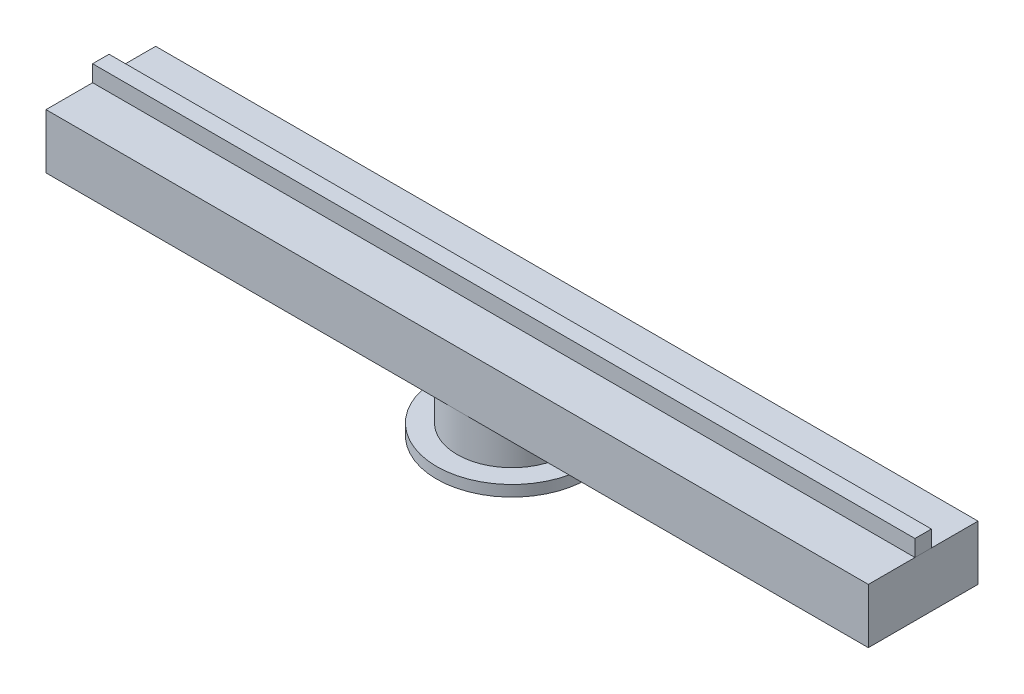
ISO-10303-21;
HEADER;
FILE_DESCRIPTION(('STEP AP214'),'2;1');
FILE_NAME('part.step','',(''),(''),'','','');
FILE_SCHEMA(('AUTOMOTIVE_DESIGN { 1 0 10303 214 1 1 1 1 }'));
ENDSEC;
DATA;
#1=APPLICATION_CONTEXT('core data for automotive mechanical design processes');
#2=APPLICATION_PROTOCOL_DEFINITION('international standard','automotive_design',2000,#1);
#3=PRODUCT_CONTEXT('',#1,'mechanical');
#4=PRODUCT('Part','Part','',(#3));
#5=PRODUCT_RELATED_PRODUCT_CATEGORY('part','',(#4));
#6=PRODUCT_DEFINITION_FORMATION('','',#4);
#7=PRODUCT_DEFINITION_CONTEXT('part definition',#1,'design');
#8=PRODUCT_DEFINITION('design','',#6,#7);
#9=PRODUCT_DEFINITION_SHAPE('','',#8);
#10=(LENGTH_UNIT() NAMED_UNIT(*) SI_UNIT(.MILLI.,.METRE.));
#11=(NAMED_UNIT(*) PLANE_ANGLE_UNIT() SI_UNIT($,.RADIAN.));
#12=(NAMED_UNIT(*) SI_UNIT($,.STERADIAN.) SOLID_ANGLE_UNIT());
#13=UNCERTAINTY_MEASURE_WITH_UNIT(LENGTH_MEASURE(1.E-05),#10,'distance_accuracy_value','');
#14=(GEOMETRIC_REPRESENTATION_CONTEXT(3) GLOBAL_UNCERTAINTY_ASSIGNED_CONTEXT((#13)) GLOBAL_UNIT_ASSIGNED_CONTEXT((#10,
#11,#12)) REPRESENTATION_CONTEXT('',''));
#15=CARTESIAN_POINT('',(0.,0.,0.));
#16=DIRECTION('',(0.,0.,1.));
#17=DIRECTION('',(1.,0.,0.));
#18=AXIS2_PLACEMENT_3D('',#15,#16,#17);
#19=CARTESIAN_POINT('',(750.,100.,15.));
#20=DIRECTION('',(0.,1.,0.));
#21=DIRECTION('',(-1.,0.,0.));
#22=AXIS2_PLACEMENT_3D('',#19,#20,#21);
#23=PLANE('',#22);
#24=DIRECTION('',(1.,0.,0.));
#25=VECTOR('',#24,1.);
#26=CARTESIAN_POINT('',(750.,100.,-15.));
#27=LINE('',#26,#25);
#28=CARTESIAN_POINT('',(-750.,99.9999999999998,-15.));
#29=VERTEX_POINT('',#28);
#30=CARTESIAN_POINT('',(750.,100.,-15.));
#31=VERTEX_POINT('',#30);
#32=EDGE_CURVE('E110',#29,#31,#27,.T.);
#33=ORIENTED_EDGE('',*,*,#32,.T.);
#34=DIRECTION('',(0.,0.,-1.));
#35=VECTOR('',#34,1.);
#36=CARTESIAN_POINT('',(750.,100.,15.));
#37=LINE('',#36,#35);
#38=CARTESIAN_POINT('',(750.,100.,15.));
#39=VERTEX_POINT('',#38);
#40=EDGE_CURVE('E12',#39,#31,#37,.T.);
#41=ORIENTED_EDGE('',*,*,#40,.F.);
#42=DIRECTION('',(1.,0.,0.));
#43=VECTOR('',#42,1.);
#44=CARTESIAN_POINT('',(750.,100.,15.));
#45=LINE('',#44,#43);
#46=CARTESIAN_POINT('',(-750.,99.9999999999998,15.));
#47=VERTEX_POINT('',#46);
#48=EDGE_CURVE('E98',#47,#39,#45,.T.);
#49=ORIENTED_EDGE('',*,*,#48,.F.);
#50=DIRECTION('',(0.,0.,-1.));
#51=VECTOR('',#50,1.);
#52=CARTESIAN_POINT('',(-750.,99.9999999999998,15.));
#53=LINE('',#52,#51);
#54=EDGE_CURVE('E106',#47,#29,#53,.T.);
#55=ORIENTED_EDGE('',*,*,#54,.T.);
#56=EDGE_LOOP('',(#33,#41,#49,#55));
#57=FACE_BOUND('',#56,.T.);
#58=ADVANCED_FACE('F47',(#57),#23,.F.);
#59=CARTESIAN_POINT('',(750.,130.,15.));
#60=DIRECTION('',(-1.,0.,0.));
#61=DIRECTION('',(0.,0.,1.));
#62=AXIS2_PLACEMENT_3D('',#59,#60,#61);
#63=PLANE('',#62);
#64=DIRECTION('',(0.,1.,0.));
#65=VECTOR('',#64,1.);
#66=CARTESIAN_POINT('',(750.,130.,-15.));
#67=LINE('',#66,#65);
#68=CARTESIAN_POINT('',(750.,130.,-15.));
#69=VERTEX_POINT('',#68);
#70=EDGE_CURVE('E102',#31,#69,#67,.T.);
#71=ORIENTED_EDGE('',*,*,#70,.T.);
#72=DIRECTION('',(0.,0.,-1.));
#73=VECTOR('',#72,1.);
#74=CARTESIAN_POINT('',(750.,130.,15.));
#75=LINE('',#74,#73);
#76=CARTESIAN_POINT('',(750.,130.,15.));
#77=VERTEX_POINT('',#76);
#78=EDGE_CURVE('E55',#77,#69,#75,.T.);
#79=ORIENTED_EDGE('',*,*,#78,.F.);
#80=DIRECTION('',(0.,1.,0.));
#81=VECTOR('',#80,1.);
#82=CARTESIAN_POINT('',(750.,130.,15.));
#83=LINE('',#82,#81);
#84=EDGE_CURVE('E93',#39,#77,#83,.T.);
#85=ORIENTED_EDGE('',*,*,#84,.F.);
#86=ORIENTED_EDGE('',*,*,#40,.T.);
#87=EDGE_LOOP('',(#71,#79,#85,#86));
#88=FACE_BOUND('',#87,.T.);
#89=ADVANCED_FACE('F101',(#88),#63,.F.);
#90=CARTESIAN_POINT('',(-750.,130.,15.));
#91=DIRECTION('',(0.,-1.,0.));
#92=DIRECTION('',(0.,0.,-1.));
#93=AXIS2_PLACEMENT_3D('',#90,#91,#92);
#94=PLANE('',#93);
#95=DIRECTION('',(-1.,0.,0.));
#96=VECTOR('',#95,1.);
#97=CARTESIAN_POINT('',(-750.,130.,-15.));
#98=LINE('',#97,#96);
#99=CARTESIAN_POINT('',(-750.,130.,-15.));
#100=VERTEX_POINT('',#99);
#101=EDGE_CURVE('E80',#69,#100,#98,.T.);
#102=ORIENTED_EDGE('',*,*,#101,.T.);
#103=DIRECTION('',(0.,0.,-1.));
#104=VECTOR('',#103,1.);
#105=CARTESIAN_POINT('',(-750.,130.,15.));
#106=LINE('',#105,#104);
#107=CARTESIAN_POINT('',(-750.,130.,15.));
#108=VERTEX_POINT('',#107);
#109=EDGE_CURVE('E103',#108,#100,#106,.T.);
#110=ORIENTED_EDGE('',*,*,#109,.F.);
#111=DIRECTION('',(-1.,0.,0.));
#112=VECTOR('',#111,1.);
#113=CARTESIAN_POINT('',(-750.,130.,15.));
#114=LINE('',#113,#112);
#115=EDGE_CURVE('E96',#77,#108,#114,.T.);
#116=ORIENTED_EDGE('',*,*,#115,.F.);
#117=ORIENTED_EDGE('',*,*,#78,.T.);
#118=EDGE_LOOP('',(#102,#110,#116,#117));
#119=FACE_BOUND('',#118,.T.);
#120=ADVANCED_FACE('F104',(#119),#94,.F.);
#121=CARTESIAN_POINT('',(-750.,99.9999999999998,15.));
#122=DIRECTION('',(1.,0.,0.));
#123=DIRECTION('',(0.,0.,-1.));
#124=AXIS2_PLACEMENT_3D('',#121,#122,#123);
#125=PLANE('',#124);
#126=DIRECTION('',(0.,-1.,0.));
#127=VECTOR('',#126,1.);
#128=CARTESIAN_POINT('',(-750.,99.9999999999998,-15.));
#129=LINE('',#128,#127);
#130=EDGE_CURVE('E86',#100,#29,#129,.T.);
#131=ORIENTED_EDGE('',*,*,#130,.T.);
#132=ORIENTED_EDGE('',*,*,#54,.F.);
#133=DIRECTION('',(0.,-1.,0.));
#134=VECTOR('',#133,1.);
#135=CARTESIAN_POINT('',(-750.,99.9999999999998,15.));
#136=LINE('',#135,#134);
#137=EDGE_CURVE('E63',#108,#47,#136,.T.);
#138=ORIENTED_EDGE('',*,*,#137,.F.);
#139=ORIENTED_EDGE('',*,*,#109,.T.);
#140=EDGE_LOOP('',(#131,#132,#138,#139));
#141=FACE_BOUND('',#140,.T.);
#142=ADVANCED_FACE('F117',(#141),#125,.F.);
#143=CARTESIAN_POINT('',(0.,0.,15.));
#144=DIRECTION('',(0.,0.,-1.));
#145=DIRECTION('',(-1.,0.,0.));
#146=AXIS2_PLACEMENT_3D('',#143,#144,#145);
#147=PLANE('',#146);
#148=ORIENTED_EDGE('',*,*,#48,.T.);
#149=ORIENTED_EDGE('',*,*,#84,.T.);
#150=ORIENTED_EDGE('',*,*,#115,.T.);
#151=ORIENTED_EDGE('',*,*,#137,.T.);
#152=EDGE_LOOP('',(#148,#149,#150,#151));
#153=FACE_BOUND('',#152,.T.);
#154=ADVANCED_FACE('F94',(#153),#147,.F.);
#155=CARTESIAN_POINT('',(0.,0.,-15.));
#156=DIRECTION('',(0.,0.,-1.));
#157=DIRECTION('',(-1.,0.,0.));
#158=AXIS2_PLACEMENT_3D('',#155,#156,#157);
#159=PLANE('',#158);
#160=ORIENTED_EDGE('',*,*,#32,.F.);
#161=ORIENTED_EDGE('',*,*,#130,.F.);
#162=ORIENTED_EDGE('',*,*,#101,.F.);
#163=ORIENTED_EDGE('',*,*,#70,.F.);
#164=EDGE_LOOP('',(#160,#161,#162,#163));
#165=FACE_BOUND('',#164,.T.);
#166=ADVANCED_FACE('F120',(#165),#159,.T.);
#167=CLOSED_SHELL('',(#58,#89,#120,#142,#154,#166));
#168=MANIFOLD_SOLID_BREP('B2',#167);
#169=CARTESIAN_POINT('',(750.,2.22044604925031E-13,100.));
#170=DIRECTION('',(0.,1.,0.));
#171=DIRECTION('',(-1.,0.,0.));
#172=AXIS2_PLACEMENT_3D('',#169,#170,#171);
#173=PLANE('',#172);
#174=DIRECTION('',(1.,0.,0.));
#175=VECTOR('',#174,1.);
#176=CARTESIAN_POINT('',(750.,2.22044604925031E-13,100.));
#177=LINE('',#176,#175);
#178=CARTESIAN_POINT('',(0.,0.,100.));
#179=VERTEX_POINT('',#178);
#180=CARTESIAN_POINT('',(750.,2.22044604925031E-13,100.));
#181=VERTEX_POINT('',#180);
#182=EDGE_CURVE('E221',#179,#181,#177,.T.);
#183=ORIENTED_EDGE('',*,*,#182,.F.);
#184=CARTESIAN_POINT('',(0.,0.,0.));
#185=DIRECTION('',(0.,1.,0.));
#186=DIRECTION('',(0.,0.,1.));
#187=AXIS2_PLACEMENT_3D('',#184,#185,#186);
#188=CIRCLE('',#187,100.);
#189=CARTESIAN_POINT('',(0.,0.,-100.));
#190=VERTEX_POINT('',#189);
#191=EDGE_CURVE('E181',#179,#190,#188,.T.);
#192=ORIENTED_EDGE('',*,*,#191,.T.);
#193=DIRECTION('',(1.,0.,0.));
#194=VECTOR('',#193,1.);
#195=CARTESIAN_POINT('',(750.,2.22044604925031E-13,-100.));
#196=LINE('',#195,#194);
#197=CARTESIAN_POINT('',(750.,2.22044604925031E-13,-100.));
#198=VERTEX_POINT('',#197);
#199=EDGE_CURVE('E232',#190,#198,#196,.T.);
#200=ORIENTED_EDGE('',*,*,#199,.T.);
#201=DIRECTION('',(0.,0.,-1.));
#202=VECTOR('',#201,1.);
#203=CARTESIAN_POINT('',(750.,2.22044604925031E-13,100.));
#204=LINE('',#203,#202);
#205=EDGE_CURVE('E175',#181,#198,#204,.T.);
#206=ORIENTED_EDGE('',*,*,#205,.F.);
#207=EDGE_LOOP('',(#183,#192,#200,#206));
#208=FACE_BOUND('',#207,.T.);
#209=ADVANCED_FACE('F171',(#208),#173,.F.);
#210=CARTESIAN_POINT('',(-750.,-2.22044604925031E-13,-100.));
#211=VERTEX_POINT('',#210);
#212=EDGE_CURVE('E238',#211,#190,#196,.T.);
#213=ORIENTED_EDGE('',*,*,#212,.T.);
#214=EDGE_CURVE('E45',#190,#179,#188,.T.);
#215=ORIENTED_EDGE('',*,*,#214,.T.);
#216=CARTESIAN_POINT('',(-750.,-2.22044604925031E-13,100.));
#217=VERTEX_POINT('',#216);
#218=EDGE_CURVE('E262',#217,#179,#177,.T.);
#219=ORIENTED_EDGE('',*,*,#218,.F.);
#220=DIRECTION('',(0.,0.,-1.));
#221=VECTOR('',#220,1.);
#222=CARTESIAN_POINT('',(-750.,-2.22044604925031E-13,100.));
#223=LINE('',#222,#221);
#224=EDGE_CURVE('E243',#217,#211,#223,.T.);
#225=ORIENTED_EDGE('',*,*,#224,.T.);
#226=EDGE_LOOP('',(#213,#215,#219,#225));
#227=FACE_BOUND('',#226,.T.);
#228=ADVANCED_FACE('F173',(#227),#173,.F.);
#229=CARTESIAN_POINT('',(750.,100.,100.));
#230=DIRECTION('',(-1.,0.,0.));
#231=DIRECTION('',(0.,0.,1.));
#232=AXIS2_PLACEMENT_3D('',#229,#230,#231);
#233=PLANE('',#232);
#234=DIRECTION('',(0.,1.,0.));
#235=VECTOR('',#234,1.);
#236=CARTESIAN_POINT('',(750.,100.,-100.));
#237=LINE('',#236,#235);
#238=CARTESIAN_POINT('',(750.,100.,-100.));
#239=VERTEX_POINT('',#238);
#240=EDGE_CURVE('E240',#198,#239,#237,.T.);
#241=ORIENTED_EDGE('',*,*,#240,.T.);
#242=DIRECTION('',(0.,0.,-1.));
#243=VECTOR('',#242,1.);
#244=CARTESIAN_POINT('',(750.,100.,100.));
#245=LINE('',#244,#243);
#246=CARTESIAN_POINT('',(750.,100.,100.));
#247=VERTEX_POINT('',#246);
#248=EDGE_CURVE('E253',#247,#239,#245,.T.);
#249=ORIENTED_EDGE('',*,*,#248,.F.);
#250=DIRECTION('',(0.,1.,0.));
#251=VECTOR('',#250,1.);
#252=CARTESIAN_POINT('',(750.,100.,100.));
#253=LINE('',#252,#251);
#254=EDGE_CURVE('E260',#181,#247,#253,.T.);
#255=ORIENTED_EDGE('',*,*,#254,.F.);
#256=ORIENTED_EDGE('',*,*,#205,.T.);
#257=EDGE_LOOP('',(#241,#249,#255,#256));
#258=FACE_BOUND('',#257,.T.);
#259=ADVANCED_FACE('F259',(#258),#233,.F.);
#260=CARTESIAN_POINT('',(-750.,99.9999999999998,100.));
#261=DIRECTION('',(0.,-1.,0.));
#262=DIRECTION('',(1.,0.,0.));
#263=AXIS2_PLACEMENT_3D('',#260,#261,#262);
#264=PLANE('',#263);
#265=DIRECTION('',(-1.,0.,0.));
#266=VECTOR('',#265,1.);
#267=CARTESIAN_POINT('',(-750.,99.9999999999998,-100.));
#268=LINE('',#267,#266);
#269=CARTESIAN_POINT('',(-750.,99.9999999999998,-100.));
#270=VERTEX_POINT('',#269);
#271=EDGE_CURVE('E244',#239,#270,#268,.T.);
#272=ORIENTED_EDGE('',*,*,#271,.T.);
#273=DIRECTION('',(0.,0.,-1.));
#274=VECTOR('',#273,1.);
#275=CARTESIAN_POINT('',(-750.,99.9999999999998,100.));
#276=LINE('',#275,#274);
#277=CARTESIAN_POINT('',(-750.,99.9999999999998,100.));
#278=VERTEX_POINT('',#277);
#279=EDGE_CURVE('E252',#278,#270,#276,.T.);
#280=ORIENTED_EDGE('',*,*,#279,.F.);
#281=DIRECTION('',(-1.,0.,0.));
#282=VECTOR('',#281,1.);
#283=CARTESIAN_POINT('',(-750.,99.9999999999998,100.));
#284=LINE('',#283,#282);
#285=EDGE_CURVE('E261',#247,#278,#284,.T.);
#286=ORIENTED_EDGE('',*,*,#285,.F.);
#287=ORIENTED_EDGE('',*,*,#248,.T.);
#288=EDGE_LOOP('',(#272,#280,#286,#287));
#289=FACE_BOUND('',#288,.T.);
#290=ADVANCED_FACE('F293',(#289),#264,.F.);
#291=CARTESIAN_POINT('',(-750.,-2.22044604925031E-13,100.));
#292=DIRECTION('',(1.,0.,0.));
#293=DIRECTION('',(0.,0.,-1.));
#294=AXIS2_PLACEMENT_3D('',#291,#292,#293);
#295=PLANE('',#294);
#296=DIRECTION('',(0.,-1.,0.));
#297=VECTOR('',#296,1.);
#298=CARTESIAN_POINT('',(-750.,-2.22044604925031E-13,-100.));
#299=LINE('',#298,#297);
#300=EDGE_CURVE('E215',#270,#211,#299,.T.);
#301=ORIENTED_EDGE('',*,*,#300,.T.);
#302=ORIENTED_EDGE('',*,*,#224,.F.);
#303=DIRECTION('',(0.,-1.,0.));
#304=VECTOR('',#303,1.);
#305=CARTESIAN_POINT('',(-750.,-2.22044604925031E-13,100.));
#306=LINE('',#305,#304);
#307=EDGE_CURVE('E194',#278,#217,#306,.T.);
#308=ORIENTED_EDGE('',*,*,#307,.F.);
#309=ORIENTED_EDGE('',*,*,#279,.T.);
#310=EDGE_LOOP('',(#301,#302,#308,#309));
#311=FACE_BOUND('',#310,.T.);
#312=ADVANCED_FACE('F297',(#311),#295,.F.);
#313=CARTESIAN_POINT('',(0.,0.,100.));
#314=DIRECTION('',(0.,0.,-1.));
#315=DIRECTION('',(-1.,0.,0.));
#316=AXIS2_PLACEMENT_3D('',#313,#314,#315);
#317=PLANE('',#316);
#318=ORIENTED_EDGE('',*,*,#218,.T.);
#319=ORIENTED_EDGE('',*,*,#182,.T.);
#320=ORIENTED_EDGE('',*,*,#254,.T.);
#321=ORIENTED_EDGE('',*,*,#285,.T.);
#322=ORIENTED_EDGE('',*,*,#307,.T.);
#323=EDGE_LOOP('',(#318,#319,#320,#321,#322));
#324=FACE_BOUND('',#323,.T.);
#325=ADVANCED_FACE('F302',(#324),#317,.F.);
#326=CARTESIAN_POINT('',(0.,0.,-100.));
#327=DIRECTION('',(0.,0.,-1.));
#328=DIRECTION('',(-1.,0.,0.));
#329=AXIS2_PLACEMENT_3D('',#326,#327,#328);
#330=PLANE('',#329);
#331=ORIENTED_EDGE('',*,*,#212,.F.);
#332=ORIENTED_EDGE('',*,*,#300,.F.);
#333=ORIENTED_EDGE('',*,*,#271,.F.);
#334=ORIENTED_EDGE('',*,*,#240,.F.);
#335=ORIENTED_EDGE('',*,*,#199,.F.);
#336=EDGE_LOOP('',(#331,#332,#333,#334,#335));
#337=FACE_BOUND('',#336,.T.);
#338=ADVANCED_FACE('F237',(#337),#330,.T.);
#339=CARTESIAN_POINT('',(0.,0.,0.));
#340=DIRECTION('',(0.,1.,0.));
#341=DIRECTION('',(0.,0.,1.));
#342=AXIS2_PLACEMENT_3D('',#339,#340,#341);
#343=CYLINDRICAL_SURFACE('',#342,100.);
#344=ORIENTED_EDGE('',*,*,#191,.F.);
#345=ORIENTED_EDGE('',*,*,#214,.F.);
#346=EDGE_LOOP('',(#344,#345));
#347=FACE_BOUND('',#346,.T.);
#348=CARTESIAN_POINT('',(0.,-70.,0.));
#349=DIRECTION('',(0.,1.,0.));
#350=DIRECTION('',(0.,0.,1.));
#351=AXIS2_PLACEMENT_3D('',#348,#349,#350);
#352=CIRCLE('',#351,100.);
#353=CARTESIAN_POINT('',(0.,-70.,100.));
#354=VERTEX_POINT('',#353);
#355=EDGE_CURVE('E234',#354,#354,#352,.T.);
#356=ORIENTED_EDGE('',*,*,#355,.T.);
#357=EDGE_LOOP('',(#356));
#358=FACE_BOUND('',#357,.T.);
#359=ADVANCED_FACE('F224',(#347,#358),#343,.T.);
#360=CARTESIAN_POINT('',(100.,-70.,0.));
#361=DIRECTION('',(0.,-1.,0.));
#362=DIRECTION('',(0.,0.,-1.));
#363=AXIS2_PLACEMENT_3D('',#360,#361,#362);
#364=PLANE('',#363);
#365=ORIENTED_EDGE('',*,*,#355,.F.);
#366=EDGE_LOOP('',(#365));
#367=FACE_BOUND('',#366,.T.);
#368=CARTESIAN_POINT('',(0.,-70.,0.));
#369=DIRECTION('',(0.,1.,0.));
#370=DIRECTION('',(0.,0.,1.));
#371=AXIS2_PLACEMENT_3D('',#368,#369,#370);
#372=CIRCLE('',#371,137.5);
#373=CARTESIAN_POINT('',(0.,-70.,137.5));
#374=VERTEX_POINT('',#373);
#375=EDGE_CURVE('E268',#374,#374,#372,.T.);
#376=ORIENTED_EDGE('',*,*,#375,.T.);
#377=EDGE_LOOP('',(#376));
#378=FACE_BOUND('',#377,.T.);
#379=ADVANCED_FACE('F283',(#367,#378),#364,.F.);
#380=CARTESIAN_POINT('',(0.,0.,0.));
#381=DIRECTION('',(0.,1.,0.));
#382=DIRECTION('',(0.,0.,1.));
#383=AXIS2_PLACEMENT_3D('',#380,#381,#382);
#384=CYLINDRICAL_SURFACE('',#383,137.5);
#385=ORIENTED_EDGE('',*,*,#375,.F.);
#386=EDGE_LOOP('',(#385));
#387=FACE_BOUND('',#386,.T.);
#388=CARTESIAN_POINT('',(0.,-90.,0.));
#389=DIRECTION('',(0.,1.,0.));
#390=DIRECTION('',(0.,0.,1.));
#391=AXIS2_PLACEMENT_3D('',#388,#389,#390);
#392=CIRCLE('',#391,137.5);
#393=CARTESIAN_POINT('',(0.,-90.,137.5));
#394=VERTEX_POINT('',#393);
#395=EDGE_CURVE('E271',#394,#394,#392,.T.);
#396=ORIENTED_EDGE('',*,*,#395,.T.);
#397=EDGE_LOOP('',(#396));
#398=FACE_BOUND('',#397,.T.);
#399=ADVANCED_FACE('F275',(#387,#398),#384,.T.);
#400=CARTESIAN_POINT('',(137.5,-90.,0.));
#401=DIRECTION('',(0.,1.,0.));
#402=DIRECTION('',(0.,0.,1.));
#403=AXIS2_PLACEMENT_3D('',#400,#401,#402);
#404=PLANE('',#403);
#405=ORIENTED_EDGE('',*,*,#395,.F.);
#406=EDGE_LOOP('',(#405));
#407=FACE_BOUND('',#406,.T.);
#408=ADVANCED_FACE('F277',(#407),#404,.F.);
#409=CLOSED_SHELL('',(#209,#228,#259,#290,#312,#325,#338,#359,#379,#399,#408));
#410=MANIFOLD_SOLID_BREP('B6',#409);
#411=ADVANCED_BREP_SHAPE_REPRESENTATION('',(#18,#168,#410),#14);
#412=SHAPE_DEFINITION_REPRESENTATION(#9,#411);
ENDSEC;
END-ISO-10303-21;
